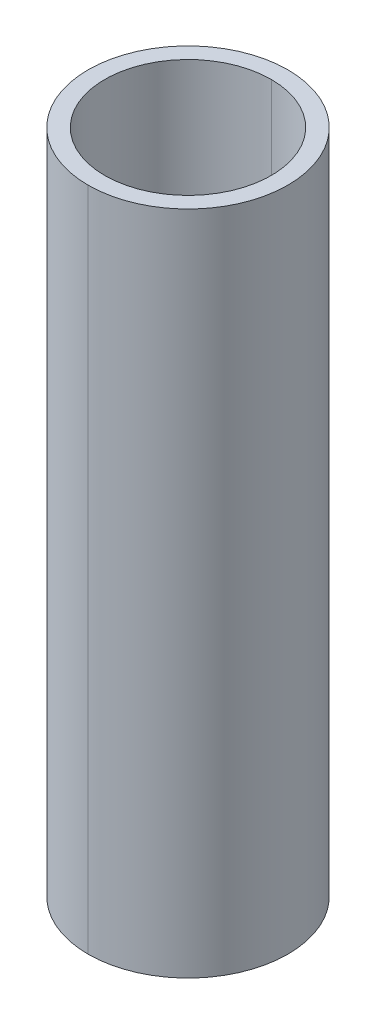
ISO-10303-21;
HEADER;
FILE_DESCRIPTION(('STEP AP214'),'2;1');
FILE_NAME('part.step','',(''),(''),'','','');
FILE_SCHEMA(('AUTOMOTIVE_DESIGN { 1 0 10303 214 1 1 1 1 }'));
ENDSEC;
DATA;
#1=APPLICATION_CONTEXT('core data for automotive mechanical design processes');
#2=APPLICATION_PROTOCOL_DEFINITION('international standard','automotive_design',2000,#1);
#3=PRODUCT_CONTEXT('',#1,'mechanical');
#4=PRODUCT('Part','Part','',(#3));
#5=PRODUCT_RELATED_PRODUCT_CATEGORY('part','',(#4));
#6=PRODUCT_DEFINITION_FORMATION('','',#4);
#7=PRODUCT_DEFINITION_CONTEXT('part definition',#1,'design');
#8=PRODUCT_DEFINITION('design','',#6,#7);
#9=PRODUCT_DEFINITION_SHAPE('','',#8);
#10=(LENGTH_UNIT() NAMED_UNIT(*) SI_UNIT(.MILLI.,.METRE.));
#11=(NAMED_UNIT(*) PLANE_ANGLE_UNIT() SI_UNIT($,.RADIAN.));
#12=(NAMED_UNIT(*) SI_UNIT($,.STERADIAN.) SOLID_ANGLE_UNIT());
#13=UNCERTAINTY_MEASURE_WITH_UNIT(LENGTH_MEASURE(1.E-05),#10,'distance_accuracy_value','');
#14=(GEOMETRIC_REPRESENTATION_CONTEXT(3) GLOBAL_UNCERTAINTY_ASSIGNED_CONTEXT((#13)) GLOBAL_UNIT_ASSIGNED_CONTEXT((#10,
#11,#12)) REPRESENTATION_CONTEXT('',''));
#15=CARTESIAN_POINT('',(0.,0.,0.));
#16=DIRECTION('',(0.,0.,1.));
#17=DIRECTION('',(1.,0.,0.));
#18=AXIS2_PLACEMENT_3D('',#15,#16,#17);
#19=CARTESIAN_POINT('',(0.,150.,0.));
#20=DIRECTION('',(0.,-1.,0.));
#21=DIRECTION('',(0.,0.,-1.));
#22=AXIS2_PLACEMENT_3D('',#19,#20,#21);
#23=CYLINDRICAL_SURFACE('',#22,5.);
#24=CARTESIAN_POINT('',(0.,40.,0.));
#25=DIRECTION('',(0.,1.,0.));
#26=DIRECTION('',(0.,0.,1.));
#27=AXIS2_PLACEMENT_3D('',#24,#25,#26);
#28=CIRCLE('',#27,5.);
#29=CARTESIAN_POINT('',(0.,40.,5.));
#30=VERTEX_POINT('',#29);
#31=CARTESIAN_POINT('',(0.,40.,-5.));
#32=VERTEX_POINT('',#31);
#33=EDGE_CURVE('E64',#30,#32,#28,.F.);
#34=ORIENTED_EDGE('',*,*,#33,.F.);
#35=DIRECTION('',(0.,-1.,0.));
#36=VECTOR('',#35,1.);
#37=CARTESIAN_POINT('',(0.,150.,5.));
#38=LINE('',#37,#36);
#39=CARTESIAN_POINT('',(0.,0.,5.));
#40=VERTEX_POINT('',#39);
#41=EDGE_CURVE('E52',#30,#40,#38,.T.);
#42=ORIENTED_EDGE('',*,*,#41,.T.);
#43=CARTESIAN_POINT('',(0.,0.,0.));
#44=DIRECTION('',(0.,1.,0.));
#45=DIRECTION('',(0.,0.,1.));
#46=AXIS2_PLACEMENT_3D('',#43,#44,#45);
#47=CIRCLE('',#46,5.);
#48=CARTESIAN_POINT('',(0.,0.,-5.));
#49=VERTEX_POINT('',#48);
#50=EDGE_CURVE('E104',#49,#40,#47,.T.);
#51=ORIENTED_EDGE('',*,*,#50,.F.);
#52=DIRECTION('',(0.,-1.,0.));
#53=VECTOR('',#52,1.);
#54=CARTESIAN_POINT('',(0.,150.,-5.));
#55=LINE('',#54,#53);
#56=EDGE_CURVE('E108',#32,#49,#55,.T.);
#57=ORIENTED_EDGE('',*,*,#56,.F.);
#58=EDGE_LOOP('',(#34,#42,#51,#57));
#59=FACE_BOUND('',#58,.T.);
#60=ADVANCED_FACE('F44',(#59),#23,.F.);
#61=CARTESIAN_POINT('',(0.,150.,0.));
#62=DIRECTION('',(0.,-1.,0.));
#63=DIRECTION('',(0.,0.,-1.));
#64=AXIS2_PLACEMENT_3D('',#61,#62,#63);
#65=CYLINDRICAL_SURFACE('',#64,6.);
#66=DIRECTION('',(0.,-1.,0.));
#67=VECTOR('',#66,1.);
#68=CARTESIAN_POINT('',(0.,150.,-6.));
#69=LINE('',#68,#67);
#70=CARTESIAN_POINT('',(0.,40.,-6.));
#71=VERTEX_POINT('',#70);
#72=CARTESIAN_POINT('',(0.,0.,-6.));
#73=VERTEX_POINT('',#72);
#74=EDGE_CURVE('E95',#71,#73,#69,.T.);
#75=ORIENTED_EDGE('',*,*,#74,.F.);
#76=CARTESIAN_POINT('',(0.,40.,0.));
#77=DIRECTION('',(0.,1.,0.));
#78=DIRECTION('',(0.,0.,1.));
#79=AXIS2_PLACEMENT_3D('',#76,#77,#78);
#80=CIRCLE('',#79,6.);
#81=CARTESIAN_POINT('',(0.,40.,6.));
#82=VERTEX_POINT('',#81);
#83=EDGE_CURVE('E58',#82,#71,#80,.T.);
#84=ORIENTED_EDGE('',*,*,#83,.F.);
#85=DIRECTION('',(0.,-1.,0.));
#86=VECTOR('',#85,1.);
#87=CARTESIAN_POINT('',(0.,150.,6.));
#88=LINE('',#87,#86);
#89=CARTESIAN_POINT('',(0.,0.,6.));
#90=VERTEX_POINT('',#89);
#91=EDGE_CURVE('E93',#82,#90,#88,.T.);
#92=ORIENTED_EDGE('',*,*,#91,.T.);
#93=CARTESIAN_POINT('',(0.,0.,0.));
#94=DIRECTION('',(0.,1.,0.));
#95=DIRECTION('',(0.,0.,1.));
#96=AXIS2_PLACEMENT_3D('',#93,#94,#95);
#97=CIRCLE('',#96,6.);
#98=EDGE_CURVE('E100',#90,#73,#97,.T.);
#99=ORIENTED_EDGE('',*,*,#98,.T.);
#100=EDGE_LOOP('',(#75,#84,#92,#99));
#101=FACE_BOUND('',#100,.T.);
#102=ADVANCED_FACE('F46',(#101),#65,.T.);
#103=CARTESIAN_POINT('',(0.,150.,0.));
#104=DIRECTION('',(0.,-1.,0.));
#105=DIRECTION('',(0.,0.,-1.));
#106=AXIS2_PLACEMENT_3D('',#103,#104,#105);
#107=CYLINDRICAL_SURFACE('',#106,6.);
#108=ORIENTED_EDGE('',*,*,#91,.F.);
#109=EDGE_CURVE('E85',#71,#82,#80,.T.);
#110=ORIENTED_EDGE('',*,*,#109,.F.);
#111=ORIENTED_EDGE('',*,*,#74,.T.);
#112=CARTESIAN_POINT('',(0.,0.,0.));
#113=DIRECTION('',(0.,1.,0.));
#114=DIRECTION('',(0.,0.,1.));
#115=AXIS2_PLACEMENT_3D('',#112,#113,#114);
#116=CIRCLE('',#115,6.);
#117=EDGE_CURVE('E99',#73,#90,#116,.T.);
#118=ORIENTED_EDGE('',*,*,#117,.T.);
#119=EDGE_LOOP('',(#108,#110,#111,#118));
#120=FACE_BOUND('',#119,.T.);
#121=ADVANCED_FACE('F97',(#120),#107,.T.);
#122=CARTESIAN_POINT('',(0.,150.,0.));
#123=DIRECTION('',(0.,-1.,0.));
#124=DIRECTION('',(0.,0.,-1.));
#125=AXIS2_PLACEMENT_3D('',#122,#123,#124);
#126=CYLINDRICAL_SURFACE('',#125,5.);
#127=CARTESIAN_POINT('',(0.,40.,0.));
#128=DIRECTION('',(0.,1.,0.));
#129=DIRECTION('',(0.,0.,1.));
#130=AXIS2_PLACEMENT_3D('',#127,#128,#129);
#131=CIRCLE('',#130,5.);
#132=EDGE_CURVE('E11',#32,#30,#131,.F.);
#133=ORIENTED_EDGE('',*,*,#132,.F.);
#134=ORIENTED_EDGE('',*,*,#56,.T.);
#135=CARTESIAN_POINT('',(0.,0.,0.));
#136=DIRECTION('',(0.,1.,0.));
#137=DIRECTION('',(0.,0.,1.));
#138=AXIS2_PLACEMENT_3D('',#135,#136,#137);
#139=CIRCLE('',#138,5.);
#140=EDGE_CURVE('E118',#40,#49,#139,.T.);
#141=ORIENTED_EDGE('',*,*,#140,.F.);
#142=ORIENTED_EDGE('',*,*,#41,.F.);
#143=EDGE_LOOP('',(#133,#134,#141,#142));
#144=FACE_BOUND('',#143,.T.);
#145=ADVANCED_FACE('F126',(#144),#126,.F.);
#146=CARTESIAN_POINT('',(0.,0.,0.));
#147=DIRECTION('',(0.,1.,0.));
#148=DIRECTION('',(1.,0.,0.));
#149=AXIS2_PLACEMENT_3D('',#146,#147,#148);
#150=PLANE('',#149);
#151=ORIENTED_EDGE('',*,*,#117,.F.);
#152=ORIENTED_EDGE('',*,*,#98,.F.);
#153=EDGE_LOOP('',(#151,#152));
#154=FACE_BOUND('',#153,.T.);
#155=ORIENTED_EDGE('',*,*,#50,.T.);
#156=ORIENTED_EDGE('',*,*,#140,.T.);
#157=EDGE_LOOP('',(#155,#156));
#158=FACE_BOUND('',#157,.T.);
#159=ADVANCED_FACE('F124',(#154,#158),#150,.F.);
#160=CARTESIAN_POINT('',(0.,40.,0.));
#161=DIRECTION('',(0.,1.,0.));
#162=DIRECTION('',(0.,0.,1.));
#163=AXIS2_PLACEMENT_3D('',#160,#161,#162);
#164=PLANE('',#163);
#165=ORIENTED_EDGE('',*,*,#83,.T.);
#166=ORIENTED_EDGE('',*,*,#109,.T.);
#167=EDGE_LOOP('',(#165,#166));
#168=FACE_BOUND('',#167,.T.);
#169=ORIENTED_EDGE('',*,*,#33,.T.);
#170=ORIENTED_EDGE('',*,*,#132,.T.);
#171=EDGE_LOOP('',(#169,#170));
#172=FACE_BOUND('',#171,.T.);
#173=ADVANCED_FACE('F86',(#168,#172),#164,.T.);
#174=CLOSED_SHELL('',(#60,#102,#121,#145,#159,#173));
#175=MANIFOLD_SOLID_BREP('B2',#174);
#176=ADVANCED_BREP_SHAPE_REPRESENTATION('',(#18,#175),#14);
#177=SHAPE_DEFINITION_REPRESENTATION(#9,#176);
ENDSEC;
END-ISO-10303-21;
